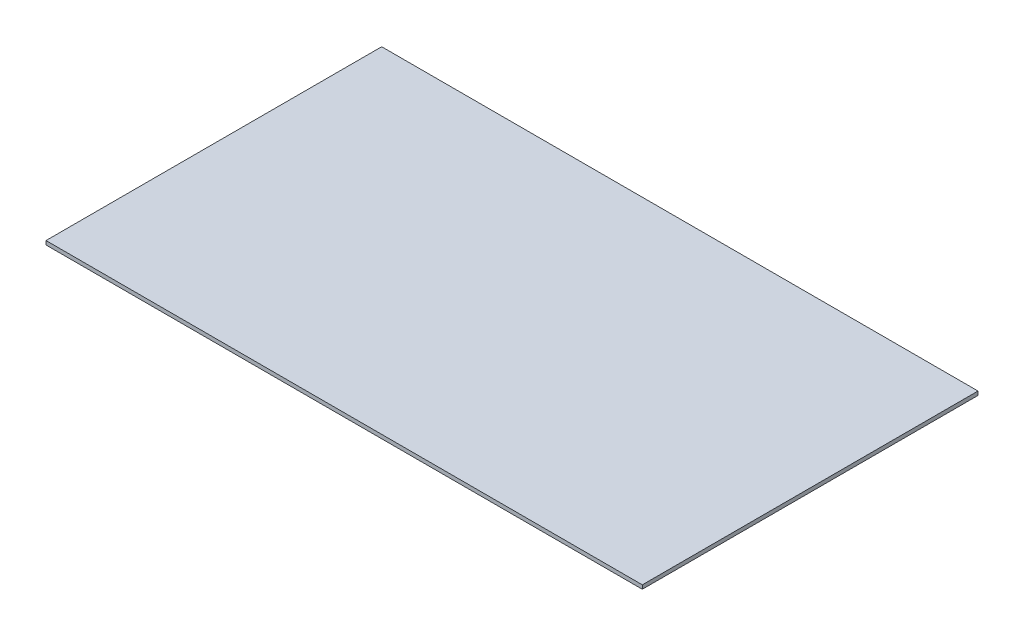
ISO-10303-21;
HEADER;
FILE_DESCRIPTION(('STEP AP214'),'2;1');
FILE_NAME('part.step','',(''),(''),'','','');
FILE_SCHEMA(('AUTOMOTIVE_DESIGN { 1 0 10303 214 1 1 1 1 }'));
ENDSEC;
DATA;
#1=APPLICATION_CONTEXT('core data for automotive mechanical design processes');
#2=APPLICATION_PROTOCOL_DEFINITION('international standard','automotive_design',2000,#1);
#3=PRODUCT_CONTEXT('',#1,'mechanical');
#4=PRODUCT('Part','Part','',(#3));
#5=PRODUCT_RELATED_PRODUCT_CATEGORY('part','',(#4));
#6=PRODUCT_DEFINITION_FORMATION('','',#4);
#7=PRODUCT_DEFINITION_CONTEXT('part definition',#1,'design');
#8=PRODUCT_DEFINITION('design','',#6,#7);
#9=PRODUCT_DEFINITION_SHAPE('','',#8);
#10=(LENGTH_UNIT() NAMED_UNIT(*) SI_UNIT(.MILLI.,.METRE.));
#11=(NAMED_UNIT(*) PLANE_ANGLE_UNIT() SI_UNIT($,.RADIAN.));
#12=(NAMED_UNIT(*) SI_UNIT($,.STERADIAN.) SOLID_ANGLE_UNIT());
#13=UNCERTAINTY_MEASURE_WITH_UNIT(LENGTH_MEASURE(1.E-05),#10,'distance_accuracy_value','');
#14=(GEOMETRIC_REPRESENTATION_CONTEXT(3) GLOBAL_UNCERTAINTY_ASSIGNED_CONTEXT((#13)) GLOBAL_UNIT_ASSIGNED_CONTEXT((#10,
#11,#12)) REPRESENTATION_CONTEXT('',''));
#15=CARTESIAN_POINT('',(0.,0.,0.));
#16=DIRECTION('',(0.,0.,1.));
#17=DIRECTION('',(1.,0.,0.));
#18=AXIS2_PLACEMENT_3D('',#15,#16,#17);
#19=CARTESIAN_POINT('',(-32.3903614457831,0.37,-18.6072289156627));
#20=DIRECTION('',(1.,0.,0.));
#21=DIRECTION('',(0.,0.,-1.));
#22=AXIS2_PLACEMENT_3D('',#19,#20,#21);
#23=PLANE('',#22);
#24=DIRECTION('',(0.,0.,1.));
#25=VECTOR('',#24,1.);
#26=CARTESIAN_POINT('',(-32.3903614457831,0.,-18.6072289156627));
#27=LINE('',#26,#25);
#28=CARTESIAN_POINT('',(-32.3903614457831,0.,-18.6072289156627));
#29=VERTEX_POINT('',#28);
#30=CARTESIAN_POINT('',(-32.3903614457831,0.,13.5927710843373));
#31=VERTEX_POINT('',#30);
#32=EDGE_CURVE('E102',#29,#31,#27,.T.);
#33=ORIENTED_EDGE('',*,*,#32,.T.);
#34=DIRECTION('',(0.,-1.,0.));
#35=VECTOR('',#34,1.);
#36=CARTESIAN_POINT('',(-32.3903614457831,0.37,13.5927710843373));
#37=LINE('',#36,#35);
#38=CARTESIAN_POINT('',(-32.3903614457831,0.37,13.5927710843373));
#39=VERTEX_POINT('',#38);
#40=EDGE_CURVE('E11',#39,#31,#37,.T.);
#41=ORIENTED_EDGE('',*,*,#40,.F.);
#42=DIRECTION('',(0.,0.,1.));
#43=VECTOR('',#42,1.);
#44=CARTESIAN_POINT('',(-32.3903614457831,0.37,-18.6072289156627));
#45=LINE('',#44,#43);
#46=CARTESIAN_POINT('',(-32.3903614457831,0.37,-18.6072289156627));
#47=VERTEX_POINT('',#46);
#48=EDGE_CURVE('E90',#47,#39,#45,.T.);
#49=ORIENTED_EDGE('',*,*,#48,.F.);
#50=DIRECTION('',(0.,-1.,0.));
#51=VECTOR('',#50,1.);
#52=CARTESIAN_POINT('',(-32.3903614457831,0.37,-18.6072289156627));
#53=LINE('',#52,#51);
#54=EDGE_CURVE('E98',#47,#29,#53,.T.);
#55=ORIENTED_EDGE('',*,*,#54,.T.);
#56=EDGE_LOOP('',(#33,#41,#49,#55));
#57=FACE_BOUND('',#56,.T.);
#58=ADVANCED_FACE('F39',(#57),#23,.F.);
#59=CARTESIAN_POINT('',(-32.3903614457831,0.37,13.5927710843373));
#60=DIRECTION('',(0.,0.,-1.));
#61=DIRECTION('',(-1.,0.,0.));
#62=AXIS2_PLACEMENT_3D('',#59,#60,#61);
#63=PLANE('',#62);
#64=DIRECTION('',(1.,0.,0.));
#65=VECTOR('',#64,1.);
#66=CARTESIAN_POINT('',(-32.3903614457831,0.,13.5927710843373));
#67=LINE('',#66,#65);
#68=CARTESIAN_POINT('',(24.8096385542169,0.,13.5927710843373));
#69=VERTEX_POINT('',#68);
#70=EDGE_CURVE('E94',#31,#69,#67,.T.);
#71=ORIENTED_EDGE('',*,*,#70,.T.);
#72=DIRECTION('',(0.,-1.,0.));
#73=VECTOR('',#72,1.);
#74=CARTESIAN_POINT('',(24.8096385542169,0.37,13.5927710843373));
#75=LINE('',#74,#73);
#76=CARTESIAN_POINT('',(24.8096385542169,0.37,13.5927710843373));
#77=VERTEX_POINT('',#76);
#78=EDGE_CURVE('E47',#77,#69,#75,.T.);
#79=ORIENTED_EDGE('',*,*,#78,.F.);
#80=DIRECTION('',(1.,0.,0.));
#81=VECTOR('',#80,1.);
#82=CARTESIAN_POINT('',(-32.3903614457831,0.37,13.5927710843373));
#83=LINE('',#82,#81);
#84=EDGE_CURVE('E85',#39,#77,#83,.T.);
#85=ORIENTED_EDGE('',*,*,#84,.F.);
#86=ORIENTED_EDGE('',*,*,#40,.T.);
#87=EDGE_LOOP('',(#71,#79,#85,#86));
#88=FACE_BOUND('',#87,.T.);
#89=ADVANCED_FACE('F93',(#88),#63,.F.);
#90=CARTESIAN_POINT('',(24.8096385542169,0.37,-18.6072289156627));
#91=DIRECTION('',(-1.,0.,0.));
#92=DIRECTION('',(0.,0.,1.));
#93=AXIS2_PLACEMENT_3D('',#90,#91,#92);
#94=PLANE('',#93);
#95=DIRECTION('',(0.,0.,-1.));
#96=VECTOR('',#95,1.);
#97=CARTESIAN_POINT('',(24.8096385542169,0.,-18.6072289156627));
#98=LINE('',#97,#96);
#99=CARTESIAN_POINT('',(24.8096385542169,0.,-18.6072289156627));
#100=VERTEX_POINT('',#99);
#101=EDGE_CURVE('E72',#69,#100,#98,.T.);
#102=ORIENTED_EDGE('',*,*,#101,.T.);
#103=DIRECTION('',(0.,-1.,0.));
#104=VECTOR('',#103,1.);
#105=CARTESIAN_POINT('',(24.8096385542169,0.37,-18.6072289156627));
#106=LINE('',#105,#104);
#107=CARTESIAN_POINT('',(24.8096385542169,0.37,-18.6072289156627));
#108=VERTEX_POINT('',#107);
#109=EDGE_CURVE('E95',#108,#100,#106,.T.);
#110=ORIENTED_EDGE('',*,*,#109,.F.);
#111=DIRECTION('',(0.,0.,-1.));
#112=VECTOR('',#111,1.);
#113=CARTESIAN_POINT('',(24.8096385542169,0.37,-18.6072289156627));
#114=LINE('',#113,#112);
#115=EDGE_CURVE('E88',#77,#108,#114,.T.);
#116=ORIENTED_EDGE('',*,*,#115,.F.);
#117=ORIENTED_EDGE('',*,*,#78,.T.);
#118=EDGE_LOOP('',(#102,#110,#116,#117));
#119=FACE_BOUND('',#118,.T.);
#120=ADVANCED_FACE('F96',(#119),#94,.F.);
#121=CARTESIAN_POINT('',(-32.3903614457831,0.37,-18.6072289156627));
#122=DIRECTION('',(0.,0.,1.));
#123=DIRECTION('',(1.,0.,0.));
#124=AXIS2_PLACEMENT_3D('',#121,#122,#123);
#125=PLANE('',#124);
#126=DIRECTION('',(-1.,0.,0.));
#127=VECTOR('',#126,1.);
#128=CARTESIAN_POINT('',(-32.3903614457831,0.,-18.6072289156627));
#129=LINE('',#128,#127);
#130=EDGE_CURVE('E78',#100,#29,#129,.T.);
#131=ORIENTED_EDGE('',*,*,#130,.T.);
#132=ORIENTED_EDGE('',*,*,#54,.F.);
#133=DIRECTION('',(-1.,0.,0.));
#134=VECTOR('',#133,1.);
#135=CARTESIAN_POINT('',(-32.3903614457831,0.37,-18.6072289156627));
#136=LINE('',#135,#134);
#137=EDGE_CURVE('E55',#108,#47,#136,.T.);
#138=ORIENTED_EDGE('',*,*,#137,.F.);
#139=ORIENTED_EDGE('',*,*,#109,.T.);
#140=EDGE_LOOP('',(#131,#132,#138,#139));
#141=FACE_BOUND('',#140,.T.);
#142=ADVANCED_FACE('F109',(#141),#125,.F.);
#143=CARTESIAN_POINT('',(0.,0.37,0.));
#144=DIRECTION('',(0.,1.,0.));
#145=DIRECTION('',(0.,0.,1.));
#146=AXIS2_PLACEMENT_3D('',#143,#144,#145);
#147=PLANE('',#146);
#148=ORIENTED_EDGE('',*,*,#48,.T.);
#149=ORIENTED_EDGE('',*,*,#84,.T.);
#150=ORIENTED_EDGE('',*,*,#115,.T.);
#151=ORIENTED_EDGE('',*,*,#137,.T.);
#152=EDGE_LOOP('',(#148,#149,#150,#151));
#153=FACE_BOUND('',#152,.T.);
#154=ADVANCED_FACE('F86',(#153),#147,.T.);
#155=CARTESIAN_POINT('',(0.,0.,0.));
#156=DIRECTION('',(0.,1.,0.));
#157=DIRECTION('',(0.,0.,1.));
#158=AXIS2_PLACEMENT_3D('',#155,#156,#157);
#159=PLANE('',#158);
#160=ORIENTED_EDGE('',*,*,#32,.F.);
#161=ORIENTED_EDGE('',*,*,#130,.F.);
#162=ORIENTED_EDGE('',*,*,#101,.F.);
#163=ORIENTED_EDGE('',*,*,#70,.F.);
#164=EDGE_LOOP('',(#160,#161,#162,#163));
#165=FACE_BOUND('',#164,.T.);
#166=ADVANCED_FACE('F112',(#165),#159,.F.);
#167=CLOSED_SHELL('',(#58,#89,#120,#142,#154,#166));
#168=MANIFOLD_SOLID_BREP('B2',#167);
#169=ADVANCED_BREP_SHAPE_REPRESENTATION('',(#18,#168),#14);
#170=SHAPE_DEFINITION_REPRESENTATION(#9,#169);
ENDSEC;
END-ISO-10303-21;
